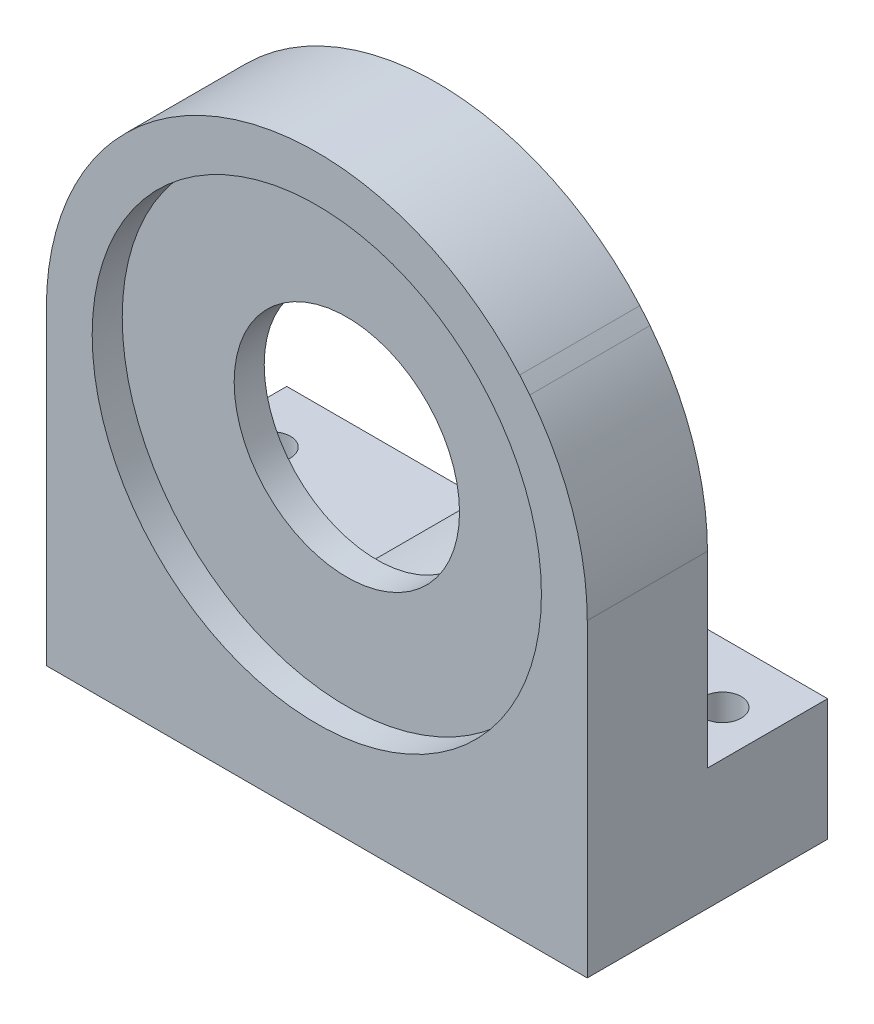
ISO-10303-21;
HEADER;
FILE_DESCRIPTION(('STEP AP214'),'2;1');
FILE_NAME('part.step','',(''),(''),'','','');
FILE_SCHEMA(('AUTOMOTIVE_DESIGN { 1 0 10303 214 1 1 1 1 }'));
ENDSEC;
DATA;
#1=APPLICATION_CONTEXT('core data for automotive mechanical design processes');
#2=APPLICATION_PROTOCOL_DEFINITION('international standard','automotive_design',2000,#1);
#3=PRODUCT_CONTEXT('',#1,'mechanical');
#4=PRODUCT('Part','Part','',(#3));
#5=PRODUCT_RELATED_PRODUCT_CATEGORY('part','',(#4));
#6=PRODUCT_DEFINITION_FORMATION('','',#4);
#7=PRODUCT_DEFINITION_CONTEXT('part definition',#1,'design');
#8=PRODUCT_DEFINITION('design','',#6,#7);
#9=PRODUCT_DEFINITION_SHAPE('','',#8);
#10=(LENGTH_UNIT() NAMED_UNIT(*) SI_UNIT(.MILLI.,.METRE.));
#11=(NAMED_UNIT(*) PLANE_ANGLE_UNIT() SI_UNIT($,.RADIAN.));
#12=(NAMED_UNIT(*) SI_UNIT($,.STERADIAN.) SOLID_ANGLE_UNIT());
#13=UNCERTAINTY_MEASURE_WITH_UNIT(LENGTH_MEASURE(1.E-05),#10,'distance_accuracy_value','');
#14=(GEOMETRIC_REPRESENTATION_CONTEXT(3) GLOBAL_UNCERTAINTY_ASSIGNED_CONTEXT((#13)) GLOBAL_UNIT_ASSIGNED_CONTEXT((#10,
#11,#12)) REPRESENTATION_CONTEXT('',''));
#15=CARTESIAN_POINT('',(0.,0.,0.));
#16=DIRECTION('',(0.,0.,1.));
#17=DIRECTION('',(1.,0.,0.));
#18=AXIS2_PLACEMENT_3D('',#15,#16,#17);
#19=CARTESIAN_POINT('',(0.,0.,-4.));
#20=DIRECTION('',(0.,0.,-1.));
#21=DIRECTION('',(-1.,0.,0.));
#22=AXIS2_PLACEMENT_3D('',#19,#20,#21);
#23=PLANE('',#22);
#24=CARTESIAN_POINT('',(0.,0.,-4.));
#25=DIRECTION('',(0.,0.,-1.));
#26=DIRECTION('',(-1.,0.,0.));
#27=AXIS2_PLACEMENT_3D('',#24,#25,#26);
#28=CIRCLE('',#27,13.5);
#29=CARTESIAN_POINT('',(-13.5,0.,-4.));
#30=VERTEX_POINT('',#29);
#31=EDGE_CURVE('E205',#30,#30,#28,.T.);
#32=ORIENTED_EDGE('',*,*,#31,.T.);
#33=EDGE_LOOP('',(#32));
#34=FACE_BOUND('',#33,.T.);
#35=CARTESIAN_POINT('',(0.,0.,-4.));
#36=DIRECTION('',(0.,0.,-1.));
#37=DIRECTION('',(-1.,0.,0.));
#38=AXIS2_PLACEMENT_3D('',#35,#36,#37);
#39=CIRCLE('',#38,7.5);
#40=CARTESIAN_POINT('',(-7.5,0.,-4.));
#41=VERTEX_POINT('',#40);
#42=EDGE_CURVE('E242',#41,#41,#39,.T.);
#43=ORIENTED_EDGE('',*,*,#42,.F.);
#44=EDGE_LOOP('',(#43));
#45=FACE_BOUND('',#44,.T.);
#46=ADVANCED_FACE('F35',(#34,#45),#23,.T.);
#47=CARTESIAN_POINT('',(-18.,-12.5,-16.));
#48=DIRECTION('',(0.,-1.,0.));
#49=DIRECTION('',(0.,0.,-1.));
#50=AXIS2_PLACEMENT_3D('',#47,#48,#49);
#51=PLANE('',#50);
#52=CARTESIAN_POINT('',(-15.,-12.5,-12.));
#53=DIRECTION('',(0.,-1.,0.));
#54=DIRECTION('',(0.,0.,-1.));
#55=AXIS2_PLACEMENT_3D('',#52,#53,#54);
#56=CIRCLE('',#55,1.24999999999999);
#57=CARTESIAN_POINT('',(-15.,-12.5,-13.25));
#58=VERTEX_POINT('',#57);
#59=EDGE_CURVE('E39',#58,#58,#56,.F.);
#60=ORIENTED_EDGE('',*,*,#59,.F.);
#61=EDGE_LOOP('',(#60));
#62=FACE_BOUND('',#61,.T.);
#63=DIRECTION('',(1.,0.,0.));
#64=VECTOR('',#63,1.);
#65=CARTESIAN_POINT('',(-18.,-12.5,-8.00000000000002));
#66=LINE('',#65,#64);
#67=CARTESIAN_POINT('',(-18.,-12.5,-8.00000000000002));
#68=VERTEX_POINT('',#67);
#69=CARTESIAN_POINT('',(-5.09901951359277,-12.5,-8.00000000000002));
#70=VERTEX_POINT('',#69);
#71=EDGE_CURVE('E181',#68,#70,#66,.T.);
#72=ORIENTED_EDGE('',*,*,#71,.T.);
#73=DIRECTION('',(0.,0.,-1.));
#74=VECTOR('',#73,1.);
#75=CARTESIAN_POINT('',(-5.09901951359277,-12.5,6.24695076595958));
#76=LINE('',#75,#74);
#77=CARTESIAN_POINT('',(-5.09901951359277,-12.5,-16.));
#78=VERTEX_POINT('',#77);
#79=EDGE_CURVE('E167',#70,#78,#76,.T.);
#80=ORIENTED_EDGE('',*,*,#79,.T.);
#81=DIRECTION('',(1.,0.,0.));
#82=VECTOR('',#81,1.);
#83=CARTESIAN_POINT('',(24.,-12.5,-16.));
#84=LINE('',#83,#82);
#85=CARTESIAN_POINT('',(-18.,-12.5,-16.));
#86=VERTEX_POINT('',#85);
#87=EDGE_CURVE('E236',#86,#78,#84,.T.);
#88=ORIENTED_EDGE('',*,*,#87,.F.);
#89=DIRECTION('',(0.,0.,-1.));
#90=VECTOR('',#89,1.);
#91=CARTESIAN_POINT('',(-18.,-12.5,-16.));
#92=LINE('',#91,#90);
#93=EDGE_CURVE('E178',#68,#86,#92,.T.);
#94=ORIENTED_EDGE('',*,*,#93,.F.);
#95=EDGE_LOOP('',(#72,#80,#88,#94));
#96=FACE_BOUND('',#95,.T.);
#97=ADVANCED_FACE('F289',(#62,#96),#51,.F.);
#98=CARTESIAN_POINT('',(0.,-20.6,-2.));
#99=DIRECTION('',(0.,1.,0.));
#100=DIRECTION('',(-1.,0.,0.));
#101=AXIS2_PLACEMENT_3D('',#98,#99,#100);
#102=PLANE('',#101);
#103=CARTESIAN_POINT('',(-15.,-20.6,-12.));
#104=DIRECTION('',(0.,-1.,0.));
#105=DIRECTION('',(0.,0.,-1.));
#106=AXIS2_PLACEMENT_3D('',#103,#104,#105);
#107=CIRCLE('',#106,1.24999999999999);
#108=CARTESIAN_POINT('',(-15.,-20.6,-13.25));
#109=VERTEX_POINT('',#108);
#110=EDGE_CURVE('E187',#109,#109,#107,.T.);
#111=ORIENTED_EDGE('',*,*,#110,.F.);
#112=EDGE_LOOP('',(#111));
#113=FACE_BOUND('',#112,.T.);
#114=CARTESIAN_POINT('',(-15.,-20.6,-4.));
#115=DIRECTION('',(0.,-1.,0.));
#116=DIRECTION('',(0.,0.,-1.));
#117=AXIS2_PLACEMENT_3D('',#114,#115,#116);
#118=CIRCLE('',#117,1.24999999999999);
#119=CARTESIAN_POINT('',(-15.,-20.6,-5.24999999999999));
#120=VERTEX_POINT('',#119);
#121=EDGE_CURVE('E190',#120,#120,#118,.T.);
#122=ORIENTED_EDGE('',*,*,#121,.F.);
#123=EDGE_LOOP('',(#122));
#124=FACE_BOUND('',#123,.T.);
#125=CARTESIAN_POINT('',(15.,-20.6,-4.));
#126=DIRECTION('',(0.,-1.,0.));
#127=DIRECTION('',(0.,0.,-1.));
#128=AXIS2_PLACEMENT_3D('',#125,#126,#127);
#129=CIRCLE('',#128,1.24999999999999);
#130=CARTESIAN_POINT('',(15.,-20.6,-5.24999999999999));
#131=VERTEX_POINT('',#130);
#132=EDGE_CURVE('E196',#131,#131,#129,.T.);
#133=ORIENTED_EDGE('',*,*,#132,.F.);
#134=EDGE_LOOP('',(#133));
#135=FACE_BOUND('',#134,.T.);
#136=CARTESIAN_POINT('',(15.,-20.6,-12.));
#137=DIRECTION('',(0.,-1.,0.));
#138=DIRECTION('',(0.,0.,-1.));
#139=AXIS2_PLACEMENT_3D('',#136,#137,#138);
#140=CIRCLE('',#139,1.24999999999999);
#141=CARTESIAN_POINT('',(15.,-20.6,-13.25));
#142=VERTEX_POINT('',#141);
#143=EDGE_CURVE('E202',#142,#142,#140,.T.);
#144=ORIENTED_EDGE('',*,*,#143,.F.);
#145=EDGE_LOOP('',(#144));
#146=FACE_BOUND('',#145,.T.);
#147=DIRECTION('',(1.,0.,0.));
#148=VECTOR('',#147,1.);
#149=CARTESIAN_POINT('',(24.,-20.6,-16.));
#150=LINE('',#149,#148);
#151=CARTESIAN_POINT('',(-18.,-20.6,-16.));
#152=VERTEX_POINT('',#151);
#153=CARTESIAN_POINT('',(18.,-20.6,-16.));
#154=VERTEX_POINT('',#153);
#155=EDGE_CURVE('E235',#152,#154,#150,.T.);
#156=ORIENTED_EDGE('',*,*,#155,.T.);
#157=DIRECTION('',(0.,0.,1.));
#158=VECTOR('',#157,1.);
#159=CARTESIAN_POINT('',(18.,-20.6,-16.001));
#160=LINE('',#159,#158);
#161=CARTESIAN_POINT('',(18.,-20.6,0.));
#162=VERTEX_POINT('',#161);
#163=EDGE_CURVE('E229',#154,#162,#160,.T.);
#164=ORIENTED_EDGE('',*,*,#163,.T.);
#165=DIRECTION('',(-1.,0.,0.));
#166=VECTOR('',#165,1.);
#167=CARTESIAN_POINT('',(0.,-20.6,0.));
#168=LINE('',#167,#166);
#169=CARTESIAN_POINT('',(-18.,-20.6,0.));
#170=VERTEX_POINT('',#169);
#171=EDGE_CURVE('E253',#162,#170,#168,.T.);
#172=ORIENTED_EDGE('',*,*,#171,.T.);
#173=DIRECTION('',(0.,0.,1.));
#174=VECTOR('',#173,1.);
#175=CARTESIAN_POINT('',(-18.,-20.6,-16.001));
#176=LINE('',#175,#174);
#177=EDGE_CURVE('E218',#152,#170,#176,.T.);
#178=ORIENTED_EDGE('',*,*,#177,.F.);
#179=EDGE_LOOP('',(#156,#164,#172,#178));
#180=FACE_BOUND('',#179,.T.);
#181=ADVANCED_FACE('F297',(#113,#124,#135,#146,#180),#102,.F.);
#182=CARTESIAN_POINT('',(24.,-12.5,-16.));
#183=DIRECTION('',(0.,0.,-1.));
#184=DIRECTION('',(-1.,0.,0.));
#185=AXIS2_PLACEMENT_3D('',#182,#183,#184);
#186=PLANE('',#185);
#187=CARTESIAN_POINT('',(0.,0.,-16.));
#188=DIRECTION('',(0.,0.,-1.));
#189=DIRECTION('',(-1.,0.,0.));
#190=AXIS2_PLACEMENT_3D('',#187,#188,#189);
#191=CIRCLE('',#190,13.5);
#192=CARTESIAN_POINT('',(5.09901951359277,-12.5,-16.));
#193=VERTEX_POINT('',#192);
#194=EDGE_CURVE('E163',#193,#78,#191,.T.);
#195=ORIENTED_EDGE('',*,*,#194,.F.);
#196=CARTESIAN_POINT('',(18.,-12.5,-16.));
#197=VERTEX_POINT('',#196);
#198=EDGE_CURVE('E240',#193,#197,#84,.T.);
#199=ORIENTED_EDGE('',*,*,#198,.T.);
#200=DIRECTION('',(0.,-1.,0.));
#201=VECTOR('',#200,1.);
#202=CARTESIAN_POINT('',(18.,0.,-16.));
#203=LINE('',#202,#201);
#204=EDGE_CURVE('E228',#197,#154,#203,.T.);
#205=ORIENTED_EDGE('',*,*,#204,.T.);
#206=ORIENTED_EDGE('',*,*,#155,.F.);
#207=DIRECTION('',(0.,-1.,0.));
#208=VECTOR('',#207,1.);
#209=CARTESIAN_POINT('',(-18.,0.,-16.));
#210=LINE('',#209,#208);
#211=EDGE_CURVE('E208',#86,#152,#210,.T.);
#212=ORIENTED_EDGE('',*,*,#211,.F.);
#213=ORIENTED_EDGE('',*,*,#87,.T.);
#214=EDGE_LOOP('',(#195,#199,#205,#206,#212,#213));
#215=FACE_BOUND('',#214,.T.);
#216=ADVANCED_FACE('F284',(#215),#186,.T.);
#217=CARTESIAN_POINT('',(0.,0.,-4.));
#218=DIRECTION('',(0.,0.,1.));
#219=DIRECTION('',(1.,0.,0.));
#220=AXIS2_PLACEMENT_3D('',#217,#218,#219);
#221=CYLINDRICAL_SURFACE('',#220,7.5);
#222=CARTESIAN_POINT('',(0.,0.,-2.));
#223=DIRECTION('',(0.,0.,-1.));
#224=DIRECTION('',(-1.,0.,0.));
#225=AXIS2_PLACEMENT_3D('',#222,#223,#224);
#226=CIRCLE('',#225,7.5);
#227=CARTESIAN_POINT('',(-7.5,0.,-2.));
#228=VERTEX_POINT('',#227);
#229=EDGE_CURVE('E239',#228,#228,#226,.T.);
#230=ORIENTED_EDGE('',*,*,#229,.F.);
#231=EDGE_LOOP('',(#230));
#232=FACE_BOUND('',#231,.T.);
#233=ORIENTED_EDGE('',*,*,#42,.T.);
#234=EDGE_LOOP('',(#233));
#235=FACE_BOUND('',#234,.T.);
#236=ADVANCED_FACE('F306',(#232,#235),#221,.F.);
#237=CARTESIAN_POINT('',(0.,0.,0.));
#238=DIRECTION('',(0.,0.,1.));
#239=DIRECTION('',(1.,0.,0.));
#240=AXIS2_PLACEMENT_3D('',#237,#238,#239);
#241=PLANE('',#240);
#242=CARTESIAN_POINT('',(0.,0.,0.));
#243=DIRECTION('',(0.,0.,1.));
#244=DIRECTION('',(1.,0.,0.));
#245=AXIS2_PLACEMENT_3D('',#242,#243,#244);
#246=CIRCLE('',#245,14.95);
#247=CARTESIAN_POINT('',(14.95,0.,0.));
#248=VERTEX_POINT('',#247);
#249=EDGE_CURVE('E251',#248,#248,#246,.T.);
#250=ORIENTED_EDGE('',*,*,#249,.F.);
#251=EDGE_LOOP('',(#250));
#252=FACE_BOUND('',#251,.T.);
#253=CARTESIAN_POINT('',(20.,-16.6204227514012,0.));
#254=DIRECTION('',(0.,0.,1.));
#255=DIRECTION('',(1.,0.,0.));
#256=AXIS2_PLACEMENT_3D('',#253,#254,#255);
#257=CIRCLE('',#256,44.);
#258=CARTESIAN_POINT('',(-13.5,11.9058808997907,0.));
#259=VERTEX_POINT('',#258);
#260=CARTESIAN_POINT('',(-14.1754906259709,11.0930368030134,0.));
#261=VERTEX_POINT('',#260);
#262=EDGE_CURVE('E11',#259,#261,#257,.T.);
#263=ORIENTED_EDGE('',*,*,#262,.T.);
#264=CARTESIAN_POINT('',(0.,0.,0.));
#265=DIRECTION('',(0.,0.,1.));
#266=DIRECTION('',(1.,0.,0.));
#267=AXIS2_PLACEMENT_3D('',#264,#265,#266);
#268=CIRCLE('',#267,18.);
#269=CARTESIAN_POINT('',(-18.,0.,0.));
#270=VERTEX_POINT('',#269);
#271=EDGE_CURVE('E59',#261,#270,#268,.T.);
#272=ORIENTED_EDGE('',*,*,#271,.T.);
#273=DIRECTION('',(0.,-1.,0.));
#274=VECTOR('',#273,1.);
#275=CARTESIAN_POINT('',(-18.,0.,0.));
#276=LINE('',#275,#274);
#277=EDGE_CURVE('E211',#270,#170,#276,.T.);
#278=ORIENTED_EDGE('',*,*,#277,.T.);
#279=ORIENTED_EDGE('',*,*,#171,.F.);
#280=DIRECTION('',(0.,-1.,0.));
#281=VECTOR('',#280,1.);
#282=CARTESIAN_POINT('',(18.,0.,0.));
#283=LINE('',#282,#281);
#284=CARTESIAN_POINT('',(18.,0.,0.));
#285=VERTEX_POINT('',#284);
#286=EDGE_CURVE('E223',#285,#162,#283,.T.);
#287=ORIENTED_EDGE('',*,*,#286,.F.);
#288=CARTESIAN_POINT('',(0.,0.,0.));
#289=DIRECTION('',(0.,0.,1.));
#290=DIRECTION('',(1.,0.,0.));
#291=AXIS2_PLACEMENT_3D('',#288,#289,#290);
#292=CIRCLE('',#291,18.);
#293=CARTESIAN_POINT('',(14.1754906259711,11.0930368030132,0.));
#294=VERTEX_POINT('',#293);
#295=EDGE_CURVE('E217',#285,#294,#292,.T.);
#296=ORIENTED_EDGE('',*,*,#295,.T.);
#297=CARTESIAN_POINT('',(-20.,-16.6204227514012,0.));
#298=DIRECTION('',(0.,0.,1.));
#299=DIRECTION('',(1.,0.,0.));
#300=AXIS2_PLACEMENT_3D('',#297,#298,#299);
#301=CIRCLE('',#300,44.);
#302=CARTESIAN_POINT('',(13.5,11.9058808997907,0.));
#303=VERTEX_POINT('',#302);
#304=EDGE_CURVE('E44',#294,#303,#301,.T.);
#305=ORIENTED_EDGE('',*,*,#304,.T.);
#306=CARTESIAN_POINT('',(0.,0.,0.));
#307=DIRECTION('',(0.,0.,1.));
#308=DIRECTION('',(1.,0.,0.));
#309=AXIS2_PLACEMENT_3D('',#306,#307,#308);
#310=CIRCLE('',#309,18.);
#311=EDGE_CURVE('E245',#303,#259,#310,.T.);
#312=ORIENTED_EDGE('',*,*,#311,.T.);
#313=EDGE_LOOP('',(#263,#272,#278,#279,#287,#296,#305,#312));
#314=FACE_BOUND('',#313,.T.);
#315=ADVANCED_FACE('F261',(#252,#314),#241,.T.);
#316=CARTESIAN_POINT('',(20.,-16.6204227514012,-2.));
#317=DIRECTION('',(0.,0.,1.));
#318=DIRECTION('',(1.,0.,0.));
#319=AXIS2_PLACEMENT_3D('',#316,#317,#318);
#320=CYLINDRICAL_SURFACE('',#319,44.);
#321=DIRECTION('',(0.,0.,1.));
#322=VECTOR('',#321,1.);
#323=CARTESIAN_POINT('',(-13.5,11.9058808997907,-2.));
#324=LINE('',#323,#322);
#325=CARTESIAN_POINT('',(-13.5,11.9058808997907,-8.00000000000002));
#326=VERTEX_POINT('',#325);
#327=EDGE_CURVE('E131',#326,#259,#324,.T.);
#328=ORIENTED_EDGE('',*,*,#327,.F.);
#329=CARTESIAN_POINT('',(20.,-16.6204227514012,-8.00000000000002));
#330=DIRECTION('',(0.,0.,-1.));
#331=DIRECTION('',(-1.,0.,0.));
#332=AXIS2_PLACEMENT_3D('',#329,#330,#331);
#333=CIRCLE('',#332,44.);
#334=CARTESIAN_POINT('',(-14.1754906259709,11.0930368030134,-8.00000000000002));
#335=VERTEX_POINT('',#334);
#336=EDGE_CURVE('E135',#335,#326,#333,.T.);
#337=ORIENTED_EDGE('',*,*,#336,.F.);
#338=DIRECTION('',(0.,0.,1.));
#339=VECTOR('',#338,1.);
#340=CARTESIAN_POINT('',(-14.1754906259708,11.0930368030135,-16.001));
#341=LINE('',#340,#339);
#342=EDGE_CURVE('E214',#335,#261,#341,.T.);
#343=ORIENTED_EDGE('',*,*,#342,.T.);
#344=ORIENTED_EDGE('',*,*,#262,.F.);
#345=EDGE_LOOP('',(#328,#337,#343,#344));
#346=FACE_BOUND('',#345,.T.);
#347=ADVANCED_FACE('F133',(#346),#320,.T.);
#348=CARTESIAN_POINT('',(-20.,-16.6204227514012,-2.));
#349=DIRECTION('',(0.,0.,1.));
#350=DIRECTION('',(1.,0.,0.));
#351=AXIS2_PLACEMENT_3D('',#348,#349,#350);
#352=CYLINDRICAL_SURFACE('',#351,44.);
#353=ORIENTED_EDGE('',*,*,#304,.F.);
#354=DIRECTION('',(0.,0.,1.));
#355=VECTOR('',#354,1.);
#356=CARTESIAN_POINT('',(14.1754906259711,11.0930368030132,-16.001));
#357=LINE('',#356,#355);
#358=CARTESIAN_POINT('',(14.1754906259711,11.0930368030132,-8.00000000000002));
#359=VERTEX_POINT('',#358);
#360=EDGE_CURVE('E226',#359,#294,#357,.T.);
#361=ORIENTED_EDGE('',*,*,#360,.F.);
#362=CARTESIAN_POINT('',(-20.,-16.6204227514012,-8.00000000000002));
#363=DIRECTION('',(0.,0.,-1.));
#364=DIRECTION('',(-1.,0.,0.));
#365=AXIS2_PLACEMENT_3D('',#362,#363,#364);
#366=CIRCLE('',#365,44.);
#367=CARTESIAN_POINT('',(13.5,11.9058808997907,-8.00000000000002));
#368=VERTEX_POINT('',#367);
#369=EDGE_CURVE('E148',#368,#359,#366,.T.);
#370=ORIENTED_EDGE('',*,*,#369,.F.);
#371=DIRECTION('',(0.,0.,1.));
#372=VECTOR('',#371,1.);
#373=CARTESIAN_POINT('',(13.5,11.9058808997907,-2.));
#374=LINE('',#373,#372);
#375=EDGE_CURVE('E140',#368,#303,#374,.T.);
#376=ORIENTED_EDGE('',*,*,#375,.T.);
#377=EDGE_LOOP('',(#353,#361,#370,#376));
#378=FACE_BOUND('',#377,.T.);
#379=ADVANCED_FACE('F37',(#378),#352,.T.);
#380=CARTESIAN_POINT('',(0.,0.,-2.));
#381=DIRECTION('',(0.,0.,1.));
#382=DIRECTION('',(1.,0.,0.));
#383=AXIS2_PLACEMENT_3D('',#380,#381,#382);
#384=CYLINDRICAL_SURFACE('',#383,18.);
#385=ORIENTED_EDGE('',*,*,#311,.F.);
#386=ORIENTED_EDGE('',*,*,#375,.F.);
#387=CARTESIAN_POINT('',(0.,0.,-8.00000000000002));
#388=DIRECTION('',(0.,0.,-1.));
#389=DIRECTION('',(-1.,0.,0.));
#390=AXIS2_PLACEMENT_3D('',#387,#388,#389);
#391=CIRCLE('',#390,18.);
#392=EDGE_CURVE('E143',#326,#368,#391,.T.);
#393=ORIENTED_EDGE('',*,*,#392,.F.);
#394=ORIENTED_EDGE('',*,*,#327,.T.);
#395=EDGE_LOOP('',(#385,#386,#393,#394));
#396=FACE_BOUND('',#395,.T.);
#397=ADVANCED_FACE('F144',(#396),#384,.T.);
#398=CARTESIAN_POINT('',(0.,0.,-2.));
#399=DIRECTION('',(0.,0.,1.));
#400=DIRECTION('',(1.,0.,0.));
#401=AXIS2_PLACEMENT_3D('',#398,#399,#400);
#402=CYLINDRICAL_SURFACE('',#401,14.95);
#403=CARTESIAN_POINT('',(0.,0.,-2.));
#404=DIRECTION('',(0.,0.,1.));
#405=DIRECTION('',(1.,0.,0.));
#406=AXIS2_PLACEMENT_3D('',#403,#404,#405);
#407=CIRCLE('',#406,14.95);
#408=CARTESIAN_POINT('',(14.95,0.,-2.));
#409=VERTEX_POINT('',#408);
#410=EDGE_CURVE('E248',#409,#409,#407,.T.);
#411=ORIENTED_EDGE('',*,*,#410,.F.);
#412=EDGE_LOOP('',(#411));
#413=FACE_BOUND('',#412,.T.);
#414=ORIENTED_EDGE('',*,*,#249,.T.);
#415=EDGE_LOOP('',(#414));
#416=FACE_BOUND('',#415,.T.);
#417=ADVANCED_FACE('F328',(#413,#416),#402,.F.);
#418=CARTESIAN_POINT('',(0.,0.,-2.));
#419=DIRECTION('',(0.,0.,-1.));
#420=DIRECTION('',(-1.,0.,0.));
#421=AXIS2_PLACEMENT_3D('',#418,#419,#420);
#422=PLANE('',#421);
#423=ORIENTED_EDGE('',*,*,#229,.T.);
#424=EDGE_LOOP('',(#423));
#425=FACE_BOUND('',#424,.T.);
#426=ORIENTED_EDGE('',*,*,#410,.T.);
#427=EDGE_LOOP('',(#426));
#428=FACE_BOUND('',#427,.T.);
#429=ADVANCED_FACE('F325',(#425,#428),#422,.F.);
#430=CARTESIAN_POINT('',(0.,0.,-16.001));
#431=DIRECTION('',(0.,0.,1.));
#432=DIRECTION('',(1.,0.,0.));
#433=AXIS2_PLACEMENT_3D('',#430,#431,#432);
#434=CYLINDRICAL_SURFACE('',#433,18.);
#435=DIRECTION('',(0.,0.,1.));
#436=VECTOR('',#435,1.);
#437=CARTESIAN_POINT('',(18.,0.,-16.001));
#438=LINE('',#437,#436);
#439=CARTESIAN_POINT('',(18.,0.,-8.00000000000002));
#440=VERTEX_POINT('',#439);
#441=EDGE_CURVE('E225',#440,#285,#438,.T.);
#442=ORIENTED_EDGE('',*,*,#441,.F.);
#443=CARTESIAN_POINT('',(0.,0.,-8.00000000000002));
#444=DIRECTION('',(0.,0.,-1.));
#445=DIRECTION('',(-1.,0.,0.));
#446=AXIS2_PLACEMENT_3D('',#443,#444,#445);
#447=CIRCLE('',#446,18.);
#448=EDGE_CURVE('E158',#359,#440,#447,.T.);
#449=ORIENTED_EDGE('',*,*,#448,.F.);
#450=ORIENTED_EDGE('',*,*,#360,.T.);
#451=ORIENTED_EDGE('',*,*,#295,.F.);
#452=EDGE_LOOP('',(#442,#449,#450,#451));
#453=FACE_BOUND('',#452,.T.);
#454=ADVANCED_FACE('F269',(#453),#434,.T.);
#455=CARTESIAN_POINT('',(18.,0.,-16.001));
#456=DIRECTION('',(-1.,0.,0.));
#457=DIRECTION('',(0.,0.,1.));
#458=AXIS2_PLACEMENT_3D('',#455,#456,#457);
#459=PLANE('',#458);
#460=DIRECTION('',(0.,-1.,0.));
#461=VECTOR('',#460,1.);
#462=CARTESIAN_POINT('',(18.,-12.5,-8.00000000000002));
#463=LINE('',#462,#461);
#464=CARTESIAN_POINT('',(18.,-12.5,-8.00000000000002));
#465=VERTEX_POINT('',#464);
#466=EDGE_CURVE('E169',#440,#465,#463,.T.);
#467=ORIENTED_EDGE('',*,*,#466,.F.);
#468=ORIENTED_EDGE('',*,*,#441,.T.);
#469=ORIENTED_EDGE('',*,*,#286,.T.);
#470=ORIENTED_EDGE('',*,*,#163,.F.);
#471=ORIENTED_EDGE('',*,*,#204,.F.);
#472=DIRECTION('',(0.,0.,-1.));
#473=VECTOR('',#472,1.);
#474=CARTESIAN_POINT('',(18.,-12.5,-16.));
#475=LINE('',#474,#473);
#476=EDGE_CURVE('E172',#465,#197,#475,.T.);
#477=ORIENTED_EDGE('',*,*,#476,.F.);
#478=EDGE_LOOP('',(#467,#468,#469,#470,#471,#477));
#479=FACE_BOUND('',#478,.T.);
#480=ADVANCED_FACE('F271',(#479),#459,.F.);
#481=CARTESIAN_POINT('',(0.,0.,-16.001));
#482=DIRECTION('',(0.,0.,1.));
#483=DIRECTION('',(1.,0.,0.));
#484=AXIS2_PLACEMENT_3D('',#481,#482,#483);
#485=CYLINDRICAL_SURFACE('',#484,18.);
#486=ORIENTED_EDGE('',*,*,#342,.F.);
#487=CARTESIAN_POINT('',(0.,0.,-8.00000000000002));
#488=DIRECTION('',(0.,0.,-1.));
#489=DIRECTION('',(-1.,0.,0.));
#490=AXIS2_PLACEMENT_3D('',#487,#488,#489);
#491=CIRCLE('',#490,18.);
#492=CARTESIAN_POINT('',(-18.,0.,-8.00000000000002));
#493=VERTEX_POINT('',#492);
#494=EDGE_CURVE('E154',#493,#335,#491,.T.);
#495=ORIENTED_EDGE('',*,*,#494,.F.);
#496=DIRECTION('',(0.,0.,1.));
#497=VECTOR('',#496,1.);
#498=CARTESIAN_POINT('',(-18.,0.,-16.001));
#499=LINE('',#498,#497);
#500=EDGE_CURVE('E215',#493,#270,#499,.T.);
#501=ORIENTED_EDGE('',*,*,#500,.T.);
#502=ORIENTED_EDGE('',*,*,#271,.F.);
#503=EDGE_LOOP('',(#486,#495,#501,#502));
#504=FACE_BOUND('',#503,.T.);
#505=ADVANCED_FACE('F294',(#504),#485,.T.);
#506=CARTESIAN_POINT('',(-18.,0.,-16.001));
#507=DIRECTION('',(-1.,0.,0.));
#508=DIRECTION('',(0.,0.,1.));
#509=AXIS2_PLACEMENT_3D('',#506,#507,#508);
#510=PLANE('',#509);
#511=ORIENTED_EDGE('',*,*,#500,.F.);
#512=DIRECTION('',(0.,-1.,0.));
#513=VECTOR('',#512,1.);
#514=CARTESIAN_POINT('',(-18.,-12.5,-8.00000000000002));
#515=LINE('',#514,#513);
#516=EDGE_CURVE('E175',#493,#68,#515,.T.);
#517=ORIENTED_EDGE('',*,*,#516,.T.);
#518=ORIENTED_EDGE('',*,*,#93,.T.);
#519=ORIENTED_EDGE('',*,*,#211,.T.);
#520=ORIENTED_EDGE('',*,*,#177,.T.);
#521=ORIENTED_EDGE('',*,*,#277,.F.);
#522=EDGE_LOOP('',(#511,#517,#518,#519,#520,#521));
#523=FACE_BOUND('',#522,.T.);
#524=ADVANCED_FACE('F291',(#523),#510,.T.);
#525=CARTESIAN_POINT('',(0.,0.,-16.001));
#526=DIRECTION('',(0.,0.,1.));
#527=DIRECTION('',(1.,0.,0.));
#528=AXIS2_PLACEMENT_3D('',#525,#526,#527);
#529=CYLINDRICAL_SURFACE('',#528,13.5);
#530=ORIENTED_EDGE('',*,*,#31,.F.);
#531=EDGE_LOOP('',(#530));
#532=FACE_BOUND('',#531,.T.);
#533=ORIENTED_EDGE('',*,*,#79,.F.);
#534=CARTESIAN_POINT('',(0.,0.,-8.00000000000002));
#535=DIRECTION('',(0.,0.,-1.));
#536=DIRECTION('',(-1.,0.,0.));
#537=AXIS2_PLACEMENT_3D('',#534,#535,#536);
#538=CIRCLE('',#537,13.5);
#539=CARTESIAN_POINT('',(5.09901951359277,-12.5,-8.00000000000002));
#540=VERTEX_POINT('',#539);
#541=EDGE_CURVE('E161',#70,#540,#538,.T.);
#542=ORIENTED_EDGE('',*,*,#541,.T.);
#543=DIRECTION('',(0.,0.,-1.));
#544=VECTOR('',#543,1.);
#545=CARTESIAN_POINT('',(5.09901951359277,-12.5,6.24695076595958));
#546=LINE('',#545,#544);
#547=EDGE_CURVE('E166',#540,#193,#546,.T.);
#548=ORIENTED_EDGE('',*,*,#547,.T.);
#549=ORIENTED_EDGE('',*,*,#194,.T.);
#550=EDGE_LOOP('',(#533,#542,#548,#549));
#551=FACE_BOUND('',#550,.T.);
#552=ADVANCED_FACE('F282',(#532,#551),#529,.F.);
#553=CARTESIAN_POINT('',(15.,-20.6,-12.));
#554=DIRECTION('',(0.,-1.,0.));
#555=DIRECTION('',(0.,0.,-1.));
#556=AXIS2_PLACEMENT_3D('',#553,#554,#555);
#557=CYLINDRICAL_SURFACE('',#556,1.24999999999999);
#558=CARTESIAN_POINT('',(15.,-12.5,-12.));
#559=DIRECTION('',(0.,-1.,0.));
#560=DIRECTION('',(0.,0.,-1.));
#561=AXIS2_PLACEMENT_3D('',#558,#559,#560);
#562=CIRCLE('',#561,1.24999999999999);
#563=CARTESIAN_POINT('',(15.,-12.5,-13.25));
#564=VERTEX_POINT('',#563);
#565=EDGE_CURVE('E184',#564,#564,#562,.F.);
#566=ORIENTED_EDGE('',*,*,#565,.T.);
#567=EDGE_LOOP('',(#566));
#568=FACE_BOUND('',#567,.T.);
#569=ORIENTED_EDGE('',*,*,#143,.T.);
#570=EDGE_LOOP('',(#569));
#571=FACE_BOUND('',#570,.T.);
#572=ADVANCED_FACE('F401',(#568,#571),#557,.F.);
#573=CARTESIAN_POINT('',(15.,-12.1,-4.));
#574=DIRECTION('',(0.,-1.,0.));
#575=DIRECTION('',(0.,0.,-1.));
#576=AXIS2_PLACEMENT_3D('',#573,#574,#575);
#577=CONICAL_SURFACE('',#576,1.24999999999999,1.02974425867665);
#578=CARTESIAN_POINT('',(15.,-11.3489242262155,-4.));
#579=VERTEX_POINT('',#578);
#580=VERTEX_LOOP('',#579);
#581=FACE_BOUND('',#580,.T.);
#582=CARTESIAN_POINT('',(15.,-12.1,-4.));
#583=DIRECTION('',(0.,-1.,0.));
#584=DIRECTION('',(0.,0.,-1.));
#585=AXIS2_PLACEMENT_3D('',#582,#583,#584);
#586=CIRCLE('',#585,1.24999999999999);
#587=CARTESIAN_POINT('',(15.,-12.1,-5.24999999999999));
#588=VERTEX_POINT('',#587);
#589=EDGE_CURVE('E199',#588,#588,#586,.T.);
#590=ORIENTED_EDGE('',*,*,#589,.T.);
#591=EDGE_LOOP('',(#590));
#592=FACE_BOUND('',#591,.T.);
#593=ADVANCED_FACE('F495',(#581,#592),#577,.F.);
#594=CARTESIAN_POINT('',(15.,-20.6,-4.));
#595=DIRECTION('',(0.,-1.,0.));
#596=DIRECTION('',(0.,0.,-1.));
#597=AXIS2_PLACEMENT_3D('',#594,#595,#596);
#598=CYLINDRICAL_SURFACE('',#597,1.24999999999999);
#599=ORIENTED_EDGE('',*,*,#589,.F.);
#600=EDGE_LOOP('',(#599));
#601=FACE_BOUND('',#600,.T.);
#602=ORIENTED_EDGE('',*,*,#132,.T.);
#603=EDGE_LOOP('',(#602));
#604=FACE_BOUND('',#603,.T.);
#605=ADVANCED_FACE('F505',(#601,#604),#598,.F.);
#606=CARTESIAN_POINT('',(-15.,-12.1,-4.));
#607=DIRECTION('',(0.,-1.,0.));
#608=DIRECTION('',(0.,0.,-1.));
#609=AXIS2_PLACEMENT_3D('',#606,#607,#608);
#610=CONICAL_SURFACE('',#609,1.24999999999999,1.02974425867665);
#611=CARTESIAN_POINT('',(-15.,-11.3489242262156,-4.));
#612=VERTEX_POINT('',#611);
#613=VERTEX_LOOP('',#612);
#614=FACE_BOUND('',#613,.T.);
#615=CARTESIAN_POINT('',(-15.,-12.1,-4.));
#616=DIRECTION('',(0.,-1.,0.));
#617=DIRECTION('',(0.,0.,-1.));
#618=AXIS2_PLACEMENT_3D('',#615,#616,#617);
#619=CIRCLE('',#618,1.24999999999999);
#620=CARTESIAN_POINT('',(-15.,-12.1,-5.24999999999999));
#621=VERTEX_POINT('',#620);
#622=EDGE_CURVE('E193',#621,#621,#619,.T.);
#623=ORIENTED_EDGE('',*,*,#622,.T.);
#624=EDGE_LOOP('',(#623));
#625=FACE_BOUND('',#624,.T.);
#626=ADVANCED_FACE('F514',(#614,#625),#610,.F.);
#627=CARTESIAN_POINT('',(-15.,-20.6,-4.));
#628=DIRECTION('',(0.,-1.,0.));
#629=DIRECTION('',(0.,0.,-1.));
#630=AXIS2_PLACEMENT_3D('',#627,#628,#629);
#631=CYLINDRICAL_SURFACE('',#630,1.24999999999999);
#632=ORIENTED_EDGE('',*,*,#622,.F.);
#633=EDGE_LOOP('',(#632));
#634=FACE_BOUND('',#633,.T.);
#635=ORIENTED_EDGE('',*,*,#121,.T.);
#636=EDGE_LOOP('',(#635));
#637=FACE_BOUND('',#636,.T.);
#638=ADVANCED_FACE('F523',(#634,#637),#631,.F.);
#639=CARTESIAN_POINT('',(-15.,-20.6,-12.));
#640=DIRECTION('',(0.,-1.,0.));
#641=DIRECTION('',(0.,0.,-1.));
#642=AXIS2_PLACEMENT_3D('',#639,#640,#641);
#643=CYLINDRICAL_SURFACE('',#642,1.24999999999999);
#644=ORIENTED_EDGE('',*,*,#59,.T.);
#645=EDGE_LOOP('',(#644));
#646=FACE_BOUND('',#645,.T.);
#647=ORIENTED_EDGE('',*,*,#110,.T.);
#648=EDGE_LOOP('',(#647));
#649=FACE_BOUND('',#648,.T.);
#650=ADVANCED_FACE('F531',(#646,#649),#643,.F.);
#651=ORIENTED_EDGE('',*,*,#547,.F.);
#652=EDGE_CURVE('E51',#540,#465,#66,.T.);
#653=ORIENTED_EDGE('',*,*,#652,.T.);
#654=ORIENTED_EDGE('',*,*,#476,.T.);
#655=ORIENTED_EDGE('',*,*,#198,.F.);
#656=EDGE_LOOP('',(#651,#653,#654,#655));
#657=FACE_BOUND('',#656,.T.);
#658=ORIENTED_EDGE('',*,*,#565,.F.);
#659=EDGE_LOOP('',(#658));
#660=FACE_BOUND('',#659,.T.);
#661=ADVANCED_FACE('F277',(#657,#660),#51,.F.);
#662=CARTESIAN_POINT('',(-18.,-12.5,-8.00000000000002));
#663=DIRECTION('',(0.,0.,1.));
#664=DIRECTION('',(1.,0.,0.));
#665=AXIS2_PLACEMENT_3D('',#662,#663,#664);
#666=PLANE('',#665);
#667=ORIENTED_EDGE('',*,*,#448,.T.);
#668=ORIENTED_EDGE('',*,*,#466,.T.);
#669=ORIENTED_EDGE('',*,*,#652,.F.);
#670=ORIENTED_EDGE('',*,*,#541,.F.);
#671=ORIENTED_EDGE('',*,*,#71,.F.);
#672=ORIENTED_EDGE('',*,*,#516,.F.);
#673=ORIENTED_EDGE('',*,*,#494,.T.);
#674=ORIENTED_EDGE('',*,*,#336,.T.);
#675=ORIENTED_EDGE('',*,*,#392,.T.);
#676=ORIENTED_EDGE('',*,*,#369,.T.);
#677=EDGE_LOOP('',(#667,#668,#669,#670,#671,#672,#673,#674,#675,#676));
#678=FACE_BOUND('',#677,.T.);
#679=ADVANCED_FACE('F151',(#678),#666,.F.);
#680=CLOSED_SHELL('',(#46,#97,#181,#216,#236,#315,#347,#379,#397,#417,#429,#454,#480,#505,#524,
#552,#572,#593,#605,#626,#638,#650,#661,#679));
#681=MANIFOLD_SOLID_BREP('B2',#680);
#682=ADVANCED_BREP_SHAPE_REPRESENTATION('',(#18,#681),#14);
#683=SHAPE_DEFINITION_REPRESENTATION(#9,#682);
ENDSEC;
END-ISO-10303-21;
